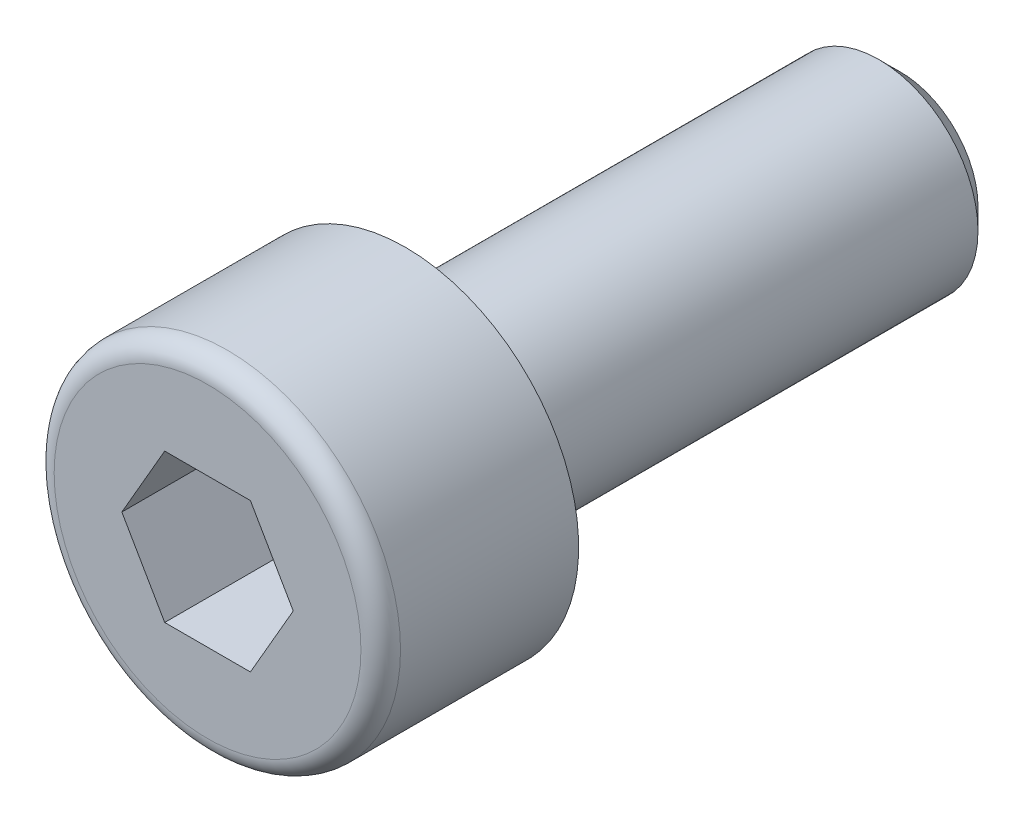
ISO-10303-21;
HEADER;
FILE_DESCRIPTION(('STEP AP214'),'2;1');
FILE_NAME('part.step','',(''),(''),'','','');
FILE_SCHEMA(('AUTOMOTIVE_DESIGN { 1 0 10303 214 1 1 1 1 }'));
ENDSEC;
DATA;
#1=APPLICATION_CONTEXT('core data for automotive mechanical design processes');
#2=APPLICATION_PROTOCOL_DEFINITION('international standard','automotive_design',2000,#1);
#3=PRODUCT_CONTEXT('',#1,'mechanical');
#4=PRODUCT('Part','Part','',(#3));
#5=PRODUCT_RELATED_PRODUCT_CATEGORY('part','',(#4));
#6=PRODUCT_DEFINITION_FORMATION('','',#4);
#7=PRODUCT_DEFINITION_CONTEXT('part definition',#1,'design');
#8=PRODUCT_DEFINITION('design','',#6,#7);
#9=PRODUCT_DEFINITION_SHAPE('','',#8);
#10=(LENGTH_UNIT() NAMED_UNIT(*) SI_UNIT(.MILLI.,.METRE.));
#11=(NAMED_UNIT(*) PLANE_ANGLE_UNIT() SI_UNIT($,.RADIAN.));
#12=(NAMED_UNIT(*) SI_UNIT($,.STERADIAN.) SOLID_ANGLE_UNIT());
#13=UNCERTAINTY_MEASURE_WITH_UNIT(LENGTH_MEASURE(1.E-05),#10,'distance_accuracy_value','');
#14=(GEOMETRIC_REPRESENTATION_CONTEXT(3) GLOBAL_UNCERTAINTY_ASSIGNED_CONTEXT((#13)) GLOBAL_UNIT_ASSIGNED_CONTEXT((#10,
#11,#12)) REPRESENTATION_CONTEXT('',''));
#15=CARTESIAN_POINT('',(0.,0.,0.));
#16=DIRECTION('',(0.,0.,1.));
#17=DIRECTION('',(1.,0.,0.));
#18=AXIS2_PLACEMENT_3D('',#15,#16,#17);
#19=CARTESIAN_POINT('',(0.,-1.5,2.50347876849692));
#20=DIRECTION('',(0.,1.,0.));
#21=DIRECTION('',(0.,0.,1.));
#22=AXIS2_PLACEMENT_3D('',#19,#20,#21);
#23=PLANE('',#22);
#24=DIRECTION('',(0.,0.,1.));
#25=VECTOR('',#24,1.);
#26=CARTESIAN_POINT('',(-0.866025403784438,-1.5,2.50347876849692));
#27=LINE('',#26,#25);
#28=CARTESIAN_POINT('',(-0.866025403784439,-1.5,4.));
#29=VERTEX_POINT('',#28);
#30=CARTESIAN_POINT('',(-0.866025403784439,-1.5,1.00695753699384));
#31=VERTEX_POINT('',#30);
#32=EDGE_CURVE('E73',#29,#31,#27,.F.);
#33=ORIENTED_EDGE('',*,*,#32,.F.);
#34=DIRECTION('',(1.,0.,0.));
#35=VECTOR('',#34,1.);
#36=CARTESIAN_POINT('',(0.,-1.5,4.));
#37=LINE('',#36,#35);
#38=CARTESIAN_POINT('',(0.866025403784439,-1.5,4.));
#39=VERTEX_POINT('',#38);
#40=EDGE_CURVE('E65',#29,#39,#37,.T.);
#41=ORIENTED_EDGE('',*,*,#40,.T.);
#42=DIRECTION('',(0.,0.,1.));
#43=VECTOR('',#42,1.);
#44=CARTESIAN_POINT('',(0.866025403784439,-1.5,2.50347876849692));
#45=LINE('',#44,#43);
#46=CARTESIAN_POINT('',(0.866025403784439,-1.5,1.00695753699384));
#47=VERTEX_POINT('',#46);
#48=EDGE_CURVE('E76',#47,#39,#45,.T.);
#49=ORIENTED_EDGE('',*,*,#48,.F.);
#50=DIRECTION('',(1.,0.,0.));
#51=VECTOR('',#50,1.);
#52=CARTESIAN_POINT('',(0.,-1.5,1.00695753699384));
#53=LINE('',#52,#51);
#54=EDGE_CURVE('E70',#47,#31,#53,.F.);
#55=ORIENTED_EDGE('',*,*,#54,.T.);
#56=EDGE_LOOP('',(#33,#41,#49,#55));
#57=FACE_BOUND('',#56,.T.);
#58=ADVANCED_FACE('F17',(#57),#23,.T.);
#59=CARTESIAN_POINT('',(-1.29903810567666,-0.750000000000001,2.50347876849692));
#60=DIRECTION('',(0.866025403784438,0.500000000000001,0.));
#61=DIRECTION('',(-0.500000000000001,0.866025403784438,0.));
#62=AXIS2_PLACEMENT_3D('',#59,#60,#61);
#63=PLANE('',#62);
#64=DIRECTION('',(0.,0.,1.));
#65=VECTOR('',#64,1.);
#66=CARTESIAN_POINT('',(-1.73205080756888,0.,2.50347876849692));
#67=LINE('',#66,#65);
#68=CARTESIAN_POINT('',(-1.73205080756888,0.,4.));
#69=VERTEX_POINT('',#68);
#70=CARTESIAN_POINT('',(-1.73205080756888,0.,1.00695753699384));
#71=VERTEX_POINT('',#70);
#72=EDGE_CURVE('E240',#69,#71,#67,.F.);
#73=ORIENTED_EDGE('',*,*,#72,.F.);
#74=DIRECTION('',(-0.500000000000001,0.866025403784438,0.));
#75=VECTOR('',#74,1.);
#76=CARTESIAN_POINT('',(-1.29903810567666,-0.750000000000001,4.));
#77=LINE('',#76,#75);
#78=EDGE_CURVE('E88',#69,#29,#77,.F.);
#79=ORIENTED_EDGE('',*,*,#78,.T.);
#80=ORIENTED_EDGE('',*,*,#32,.T.);
#81=DIRECTION('',(-0.500000000000001,0.866025403784438,0.));
#82=VECTOR('',#81,1.);
#83=CARTESIAN_POINT('',(-1.29903810567666,-0.750000000000001,1.00695753699384));
#84=LINE('',#83,#82);
#85=EDGE_CURVE('E81',#31,#71,#84,.T.);
#86=ORIENTED_EDGE('',*,*,#85,.T.);
#87=EDGE_LOOP('',(#73,#79,#80,#86));
#88=FACE_BOUND('',#87,.T.);
#89=ADVANCED_FACE('F90',(#88),#63,.T.);
#90=CARTESIAN_POINT('',(1.29903810567666,-0.749999999999999,2.50347876849692));
#91=DIRECTION('',(-0.866025403784439,0.5,0.));
#92=DIRECTION('',(-0.5,-0.866025403784439,0.));
#93=AXIS2_PLACEMENT_3D('',#90,#91,#92);
#94=PLANE('',#93);
#95=ORIENTED_EDGE('',*,*,#48,.T.);
#96=DIRECTION('',(-0.5,-0.866025403784439,0.));
#97=VECTOR('',#96,1.);
#98=CARTESIAN_POINT('',(1.29903810567666,-0.749999999999999,4.));
#99=LINE('',#98,#97);
#100=CARTESIAN_POINT('',(1.73205080756888,0.,4.));
#101=VERTEX_POINT('',#100);
#102=EDGE_CURVE('E242',#39,#101,#99,.F.);
#103=ORIENTED_EDGE('',*,*,#102,.T.);
#104=DIRECTION('',(0.,0.,1.));
#105=VECTOR('',#104,1.);
#106=CARTESIAN_POINT('',(1.73205080756888,0.,2.50347876849692));
#107=LINE('',#106,#105);
#108=CARTESIAN_POINT('',(1.73205080756888,0.,1.00695753699384));
#109=VERTEX_POINT('',#108);
#110=EDGE_CURVE('E230',#109,#101,#107,.T.);
#111=ORIENTED_EDGE('',*,*,#110,.F.);
#112=DIRECTION('',(-0.5,-0.866025403784439,0.));
#113=VECTOR('',#112,1.);
#114=CARTESIAN_POINT('',(1.73205080756888,0.,1.00695753699384));
#115=LINE('',#114,#113);
#116=EDGE_CURVE('E236',#109,#47,#115,.T.);
#117=ORIENTED_EDGE('',*,*,#116,.T.);
#118=EDGE_LOOP('',(#95,#103,#111,#117));
#119=FACE_BOUND('',#118,.T.);
#120=ADVANCED_FACE('F149',(#119),#94,.T.);
#121=CARTESIAN_POINT('',(-1.29903810567666,0.749999999999999,2.50347876849692));
#122=DIRECTION('',(0.866025403784439,-0.5,0.));
#123=DIRECTION('',(0.5,0.866025403784439,0.));
#124=AXIS2_PLACEMENT_3D('',#121,#122,#123);
#125=PLANE('',#124);
#126=DIRECTION('',(0.,0.,-1.));
#127=VECTOR('',#126,1.);
#128=CARTESIAN_POINT('',(-0.866025403784439,1.5,2.50347876849692));
#129=LINE('',#128,#127);
#130=CARTESIAN_POINT('',(-0.866025403784438,1.5,4.));
#131=VERTEX_POINT('',#130);
#132=CARTESIAN_POINT('',(-0.866025403784439,1.5,1.00695753699384));
#133=VERTEX_POINT('',#132);
#134=EDGE_CURVE('E225',#131,#133,#129,.T.);
#135=ORIENTED_EDGE('',*,*,#134,.F.);
#136=DIRECTION('',(0.5,0.866025403784439,0.));
#137=VECTOR('',#136,1.);
#138=CARTESIAN_POINT('',(-1.29903810567666,0.749999999999999,4.));
#139=LINE('',#138,#137);
#140=EDGE_CURVE('E35',#131,#69,#139,.F.);
#141=ORIENTED_EDGE('',*,*,#140,.T.);
#142=ORIENTED_EDGE('',*,*,#72,.T.);
#143=DIRECTION('',(0.499999999999999,0.866025403784439,0.));
#144=VECTOR('',#143,1.);
#145=CARTESIAN_POINT('',(-1.73205080756888,0.,1.00695753699384));
#146=LINE('',#145,#144);
#147=EDGE_CURVE('E84',#71,#133,#146,.T.);
#148=ORIENTED_EDGE('',*,*,#147,.T.);
#149=EDGE_LOOP('',(#135,#141,#142,#148));
#150=FACE_BOUND('',#149,.T.);
#151=ADVANCED_FACE('F146',(#150),#125,.T.);
#152=CARTESIAN_POINT('',(0.,0.,1.00695753699384));
#153=DIRECTION('',(0.,0.,-1.));
#154=DIRECTION('',(0.,1.,0.));
#155=AXIS2_PLACEMENT_3D('',#152,#153,#154);
#156=PLANE('',#155);
#157=DIRECTION('',(0.500000000000001,-0.866025403784438,0.));
#158=VECTOR('',#157,1.);
#159=CARTESIAN_POINT('',(1.29903810567666,0.750000000000001,1.00695753699384));
#160=LINE('',#159,#158);
#161=CARTESIAN_POINT('',(0.866025403784438,1.5,1.00695753699384));
#162=VERTEX_POINT('',#161);
#163=EDGE_CURVE('E233',#162,#109,#160,.T.);
#164=ORIENTED_EDGE('',*,*,#163,.F.);
#165=DIRECTION('',(1.,0.,0.));
#166=VECTOR('',#165,1.);
#167=CARTESIAN_POINT('',(0.,1.5,1.00695753699384));
#168=LINE('',#167,#166);
#169=EDGE_CURVE('E222',#133,#162,#168,.T.);
#170=ORIENTED_EDGE('',*,*,#169,.F.);
#171=ORIENTED_EDGE('',*,*,#147,.F.);
#172=ORIENTED_EDGE('',*,*,#85,.F.);
#173=ORIENTED_EDGE('',*,*,#54,.F.);
#174=ORIENTED_EDGE('',*,*,#116,.F.);
#175=EDGE_LOOP('',(#164,#170,#171,#172,#173,#174));
#176=FACE_BOUND('',#175,.T.);
#177=ADVANCED_FACE('F82',(#176),#156,.F.);
#178=CARTESIAN_POINT('',(1.29903810567666,0.750000000000001,2.50347876849692));
#179=DIRECTION('',(-0.866025403784438,-0.500000000000001,0.));
#180=DIRECTION('',(0.500000000000001,-0.866025403784438,0.));
#181=AXIS2_PLACEMENT_3D('',#178,#179,#180);
#182=PLANE('',#181);
#183=ORIENTED_EDGE('',*,*,#110,.T.);
#184=DIRECTION('',(0.500000000000001,-0.866025403784438,0.));
#185=VECTOR('',#184,1.);
#186=CARTESIAN_POINT('',(1.29903810567666,0.75,4.));
#187=LINE('',#186,#185);
#188=CARTESIAN_POINT('',(0.866025403784438,1.5,4.));
#189=VERTEX_POINT('',#188);
#190=EDGE_CURVE('E228',#101,#189,#187,.F.);
#191=ORIENTED_EDGE('',*,*,#190,.T.);
#192=DIRECTION('',(0.,0.,-1.));
#193=VECTOR('',#192,1.);
#194=CARTESIAN_POINT('',(0.866025403784439,1.5,2.50347876849692));
#195=LINE('',#194,#193);
#196=EDGE_CURVE('E214',#162,#189,#195,.F.);
#197=ORIENTED_EDGE('',*,*,#196,.F.);
#198=ORIENTED_EDGE('',*,*,#163,.T.);
#199=EDGE_LOOP('',(#183,#191,#197,#198));
#200=FACE_BOUND('',#199,.T.);
#201=ADVANCED_FACE('F139',(#200),#182,.T.);
#202=CARTESIAN_POINT('',(0.,1.5,2.50347876849692));
#203=DIRECTION('',(0.,-1.,0.));
#204=DIRECTION('',(0.,0.,-1.));
#205=AXIS2_PLACEMENT_3D('',#202,#203,#204);
#206=PLANE('',#205);
#207=ORIENTED_EDGE('',*,*,#196,.T.);
#208=DIRECTION('',(1.,0.,0.));
#209=VECTOR('',#208,1.);
#210=CARTESIAN_POINT('',(0.,1.5,4.));
#211=LINE('',#210,#209);
#212=EDGE_CURVE('E110',#131,#189,#211,.T.);
#213=ORIENTED_EDGE('',*,*,#212,.F.);
#214=ORIENTED_EDGE('',*,*,#134,.T.);
#215=ORIENTED_EDGE('',*,*,#169,.T.);
#216=EDGE_LOOP('',(#207,#213,#214,#215));
#217=FACE_BOUND('',#216,.T.);
#218=ADVANCED_FACE('F134',(#217),#206,.T.);
#219=CARTESIAN_POINT('',(0.,0.,4.));
#220=DIRECTION('',(0.,0.,1.));
#221=DIRECTION('',(0.,-1.,0.));
#222=AXIS2_PLACEMENT_3D('',#219,#220,#221);
#223=PLANE('',#222);
#224=CARTESIAN_POINT('',(0.,0.,4.));
#225=DIRECTION('',(0.,0.,-1.));
#226=DIRECTION('',(1.,0.,0.));
#227=AXIS2_PLACEMENT_3D('',#224,#225,#226);
#228=CIRCLE('',#227,3.1);
#229=CARTESIAN_POINT('',(3.1,0.,4.));
#230=VERTEX_POINT('',#229);
#231=EDGE_CURVE('E105',#230,#230,#228,.T.);
#232=ORIENTED_EDGE('',*,*,#231,.F.);
#233=EDGE_LOOP('',(#232));
#234=FACE_BOUND('',#233,.T.);
#235=ORIENTED_EDGE('',*,*,#140,.F.);
#236=ORIENTED_EDGE('',*,*,#212,.T.);
#237=ORIENTED_EDGE('',*,*,#190,.F.);
#238=ORIENTED_EDGE('',*,*,#102,.F.);
#239=ORIENTED_EDGE('',*,*,#40,.F.);
#240=ORIENTED_EDGE('',*,*,#78,.F.);
#241=EDGE_LOOP('',(#235,#236,#237,#238,#239,#240));
#242=FACE_BOUND('',#241,.T.);
#243=ADVANCED_FACE('F123',(#234,#242),#223,.T.);
#244=CARTESIAN_POINT('',(0.,0.,3.6));
#245=DIRECTION('',(0.,0.,-1.));
#246=DIRECTION('',(1.,0.,0.));
#247=AXIS2_PLACEMENT_3D('',#244,#245,#246);
#248=TOROIDAL_SURFACE('',#247,3.1,0.4);
#249=CARTESIAN_POINT('',(0.,0.,3.6));
#250=DIRECTION('',(0.,0.,-1.));
#251=DIRECTION('',(0.,1.,0.));
#252=AXIS2_PLACEMENT_3D('',#249,#250,#251);
#253=CIRCLE('',#252,3.5);
#254=CARTESIAN_POINT('',(0.,3.5,3.6));
#255=VERTEX_POINT('',#254);
#256=EDGE_CURVE('E101',#255,#255,#253,.T.);
#257=ORIENTED_EDGE('',*,*,#256,.F.);
#258=EDGE_LOOP('',(#257));
#259=FACE_BOUND('',#258,.T.);
#260=ORIENTED_EDGE('',*,*,#231,.T.);
#261=EDGE_LOOP('',(#260));
#262=FACE_BOUND('',#261,.T.);
#263=ADVANCED_FACE('F133',(#259,#262),#248,.T.);
#264=CARTESIAN_POINT('',(0.,0.,1.8));
#265=DIRECTION('',(0.,0.,-1.));
#266=DIRECTION('',(0.,1.,0.));
#267=AXIS2_PLACEMENT_3D('',#264,#265,#266);
#268=CYLINDRICAL_SURFACE('',#267,3.5);
#269=CARTESIAN_POINT('',(0.,0.,0.));
#270=DIRECTION('',(0.,0.,-1.));
#271=DIRECTION('',(0.,1.,0.));
#272=AXIS2_PLACEMENT_3D('',#269,#270,#271);
#273=CIRCLE('',#272,3.5);
#274=CARTESIAN_POINT('',(0.,3.5,0.));
#275=VERTEX_POINT('',#274);
#276=EDGE_CURVE('E20',#275,#275,#273,.T.);
#277=ORIENTED_EDGE('',*,*,#276,.F.);
#278=EDGE_LOOP('',(#277));
#279=FACE_BOUND('',#278,.T.);
#280=ORIENTED_EDGE('',*,*,#256,.T.);
#281=EDGE_LOOP('',(#280));
#282=FACE_BOUND('',#281,.T.);
#283=ADVANCED_FACE('F199',(#279,#282),#268,.T.);
#284=CARTESIAN_POINT('',(0.,0.,-10.));
#285=DIRECTION('',(0.,0.,1.));
#286=DIRECTION('',(0.,-1.,0.));
#287=AXIS2_PLACEMENT_3D('',#284,#285,#286);
#288=PLANE('',#287);
#289=CARTESIAN_POINT('',(0.,0.,-9.99999999999091));
#290=DIRECTION('',(0.,0.,1.));
#291=DIRECTION('',(1.,0.,0.));
#292=AXIS2_PLACEMENT_3D('',#289,#290,#291);
#293=CIRCLE('',#292,1.57059999997955);
#294=CARTESIAN_POINT('',(1.57059999997955,0.,-9.99999999999091));
#295=VERTEX_POINT('',#294);
#296=EDGE_CURVE('E94',#295,#295,#293,.T.);
#297=ORIENTED_EDGE('',*,*,#296,.F.);
#298=EDGE_LOOP('',(#297));
#299=FACE_BOUND('',#298,.T.);
#300=ADVANCED_FACE('F197',(#299),#288,.F.);
#301=CARTESIAN_POINT('',(0.,0.,0.));
#302=DIRECTION('',(0.,0.,-1.));
#303=DIRECTION('',(0.,1.,0.));
#304=AXIS2_PLACEMENT_3D('',#301,#302,#303);
#305=PLANE('',#304);
#306=ORIENTED_EDGE('',*,*,#276,.T.);
#307=EDGE_LOOP('',(#306));
#308=FACE_BOUND('',#307,.T.);
#309=CARTESIAN_POINT('',(0.,0.,0.));
#310=DIRECTION('',(0.,0.,-1.));
#311=DIRECTION('',(1.,0.,0.));
#312=AXIS2_PLACEMENT_3D('',#309,#310,#311);
#313=CIRCLE('',#312,2.2);
#314=CARTESIAN_POINT('',(2.2,0.,0.));
#315=VERTEX_POINT('',#314);
#316=EDGE_CURVE('E96',#315,#315,#313,.F.);
#317=ORIENTED_EDGE('',*,*,#316,.T.);
#318=EDGE_LOOP('',(#317));
#319=FACE_BOUND('',#318,.T.);
#320=ADVANCED_FACE('F188',(#308,#319),#305,.T.);
#321=CARTESIAN_POINT('',(0.,0.,-9.57060000007459));
#322=DIRECTION('',(0.,0.,1.));
#323=DIRECTION('',(1.,0.,0.));
#324=AXIS2_PLACEMENT_3D('',#321,#322,#323);
#325=CONICAL_SURFACE('',#324,1.99999999989586,0.785398163397448);
#326=ORIENTED_EDGE('',*,*,#296,.T.);
#327=EDGE_LOOP('',(#326));
#328=FACE_BOUND('',#327,.T.);
#329=CARTESIAN_POINT('',(0.,0.,-9.5706));
#330=DIRECTION('',(0.,0.,-1.));
#331=DIRECTION('',(0.,1.,0.));
#332=AXIS2_PLACEMENT_3D('',#329,#330,#331);
#333=CIRCLE('',#332,2.);
#334=CARTESIAN_POINT('',(0.,2.,-9.5706));
#335=VERTEX_POINT('',#334);
#336=EDGE_CURVE('E26',#335,#335,#333,.F.);
#337=ORIENTED_EDGE('',*,*,#336,.F.);
#338=EDGE_LOOP('',(#337));
#339=FACE_BOUND('',#338,.T.);
#340=ADVANCED_FACE('F167',(#328,#339),#325,.T.);
#341=CARTESIAN_POINT('',(0.,0.,-0.2));
#342=DIRECTION('',(0.,0.,-1.));
#343=DIRECTION('',(1.,0.,0.));
#344=AXIS2_PLACEMENT_3D('',#341,#342,#343);
#345=TOROIDAL_SURFACE('',#344,2.2,0.2);
#346=ORIENTED_EDGE('',*,*,#316,.F.);
#347=EDGE_LOOP('',(#346));
#348=FACE_BOUND('',#347,.T.);
#349=CARTESIAN_POINT('',(0.,0.,-0.200000000000001));
#350=DIRECTION('',(0.,0.,-1.));
#351=DIRECTION('',(0.,1.,0.));
#352=AXIS2_PLACEMENT_3D('',#349,#350,#351);
#353=CIRCLE('',#352,2.);
#354=CARTESIAN_POINT('',(0.,2.,-0.200000000000001));
#355=VERTEX_POINT('',#354);
#356=EDGE_CURVE('E11',#355,#355,#353,.T.);
#357=ORIENTED_EDGE('',*,*,#356,.F.);
#358=EDGE_LOOP('',(#357));
#359=FACE_BOUND('',#358,.T.);
#360=ADVANCED_FACE('F160',(#348,#359),#345,.F.);
#361=CARTESIAN_POINT('',(0.,0.,-4.7853));
#362=DIRECTION('',(0.,0.,-1.));
#363=DIRECTION('',(0.,1.,0.));
#364=AXIS2_PLACEMENT_3D('',#361,#362,#363);
#365=CYLINDRICAL_SURFACE('',#364,2.);
#366=ORIENTED_EDGE('',*,*,#336,.T.);
#367=EDGE_LOOP('',(#366));
#368=FACE_BOUND('',#367,.T.);
#369=ORIENTED_EDGE('',*,*,#356,.T.);
#370=EDGE_LOOP('',(#369));
#371=FACE_BOUND('',#370,.T.);
#372=ADVANCED_FACE('F158',(#368,#371),#365,.T.);
#373=CLOSED_SHELL('',(#58,#89,#120,#151,#177,#201,#218,#243,#263,#283,#300,#320,#340,#360,#372));
#374=CARTESIAN_POINT('',(0.,0.,0.));
#375=DIRECTION('',(0.,0.,-1.));
#376=DIRECTION('',(1.,0.,0.));
#377=AXIS2_PLACEMENT_3D('',#374,#375,#376);
#378=TOROIDAL_SURFACE('',#377,2.,0.04);
#379=ADVANCED_FACE('F173',(),#378,.F.);
#380=CLOSED_SHELL('',(#379));
#381=ORIENTED_CLOSED_SHELL('',*,#380,.T.);
#382=BREP_WITH_VOIDS('B1',#373,(#381));
#383=ADVANCED_BREP_SHAPE_REPRESENTATION('',(#18,#382),#14);
#384=SHAPE_DEFINITION_REPRESENTATION(#9,#383);
ENDSEC;
END-ISO-10303-21;
